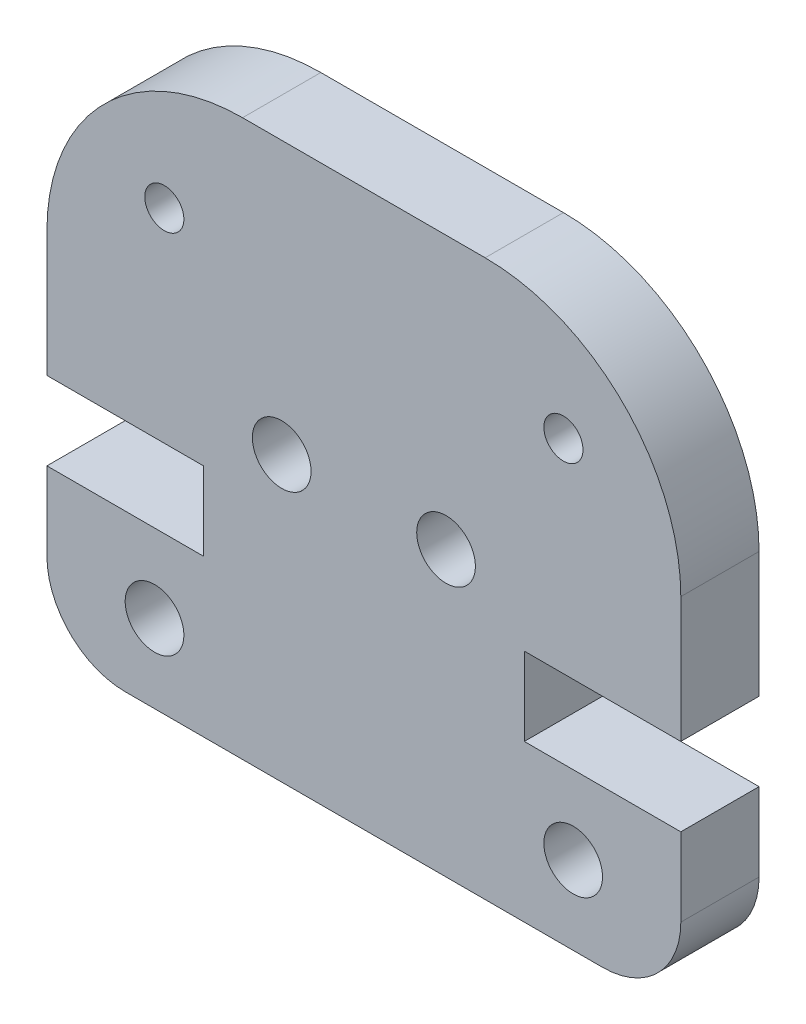
ISO-10303-21;
HEADER;
FILE_DESCRIPTION(('STEP AP214'),'2;1');
FILE_NAME('part.step','',(''),(''),'','','');
FILE_SCHEMA(('AUTOMOTIVE_DESIGN { 1 0 10303 214 1 1 1 1 }'));
ENDSEC;
DATA;
#1=APPLICATION_CONTEXT('core data for automotive mechanical design processes');
#2=APPLICATION_PROTOCOL_DEFINITION('international standard','automotive_design',2000,#1);
#3=PRODUCT_CONTEXT('',#1,'mechanical');
#4=PRODUCT('Part','Part','',(#3));
#5=PRODUCT_RELATED_PRODUCT_CATEGORY('part','',(#4));
#6=PRODUCT_DEFINITION_FORMATION('','',#4);
#7=PRODUCT_DEFINITION_CONTEXT('part definition',#1,'design');
#8=PRODUCT_DEFINITION('design','',#6,#7);
#9=PRODUCT_DEFINITION_SHAPE('','',#8);
#10=(LENGTH_UNIT() NAMED_UNIT(*) SI_UNIT(.MILLI.,.METRE.));
#11=(NAMED_UNIT(*) PLANE_ANGLE_UNIT() SI_UNIT($,.RADIAN.));
#12=(NAMED_UNIT(*) SI_UNIT($,.STERADIAN.) SOLID_ANGLE_UNIT());
#13=UNCERTAINTY_MEASURE_WITH_UNIT(LENGTH_MEASURE(1.E-05),#10,'distance_accuracy_value','');
#14=(GEOMETRIC_REPRESENTATION_CONTEXT(3) GLOBAL_UNCERTAINTY_ASSIGNED_CONTEXT((#13)) GLOBAL_UNIT_ASSIGNED_CONTEXT((#10,
#11,#12)) REPRESENTATION_CONTEXT('',''));
#15=CARTESIAN_POINT('',(0.,0.,0.));
#16=DIRECTION('',(0.,0.,1.));
#17=DIRECTION('',(1.,0.,0.));
#18=AXIS2_PLACEMENT_3D('',#15,#16,#17);
#19=CARTESIAN_POINT('',(14.2,2.00000000000002,2.));
#20=DIRECTION('',(0.,0.,-1.));
#21=DIRECTION('',(-1.,0.,0.));
#22=AXIS2_PLACEMENT_3D('',#19,#20,#21);
#23=PLANE('',#22);
#24=CARTESIAN_POINT('',(3.00000000000434,11.2049999999999,2.));
#25=DIRECTION('',(0.,0.,1.));
#26=DIRECTION('',(1.,0.,0.));
#27=AXIS2_PLACEMENT_3D('',#24,#25,#26);
#28=CIRCLE('',#27,0.499999999999944);
#29=CARTESIAN_POINT('',(3.50000000000429,11.2049999999999,2.));
#30=VERTEX_POINT('',#29);
#31=EDGE_CURVE('E352',#30,#30,#28,.T.);
#32=ORIENTED_EDGE('',*,*,#31,.F.);
#33=EDGE_LOOP('',(#32));
#34=FACE_BOUND('',#33,.T.);
#35=CARTESIAN_POINT('',(10.2000000000053,7.25000000000003,2.));
#36=DIRECTION('',(0.,0.,1.));
#37=DIRECTION('',(-1.,0.,0.));
#38=AXIS2_PLACEMENT_3D('',#35,#36,#37);
#39=CIRCLE('',#38,0.75);
#40=CARTESIAN_POINT('',(9.45000000000532,7.25000000000003,2.));
#41=VERTEX_POINT('',#40);
#42=EDGE_CURVE('E364',#41,#41,#39,.T.);
#43=ORIENTED_EDGE('',*,*,#42,.F.);
#44=EDGE_LOOP('',(#43));
#45=FACE_BOUND('',#44,.T.);
#46=CARTESIAN_POINT('',(13.45,2.00000000000002,2.));
#47=DIRECTION('',(0.,0.,1.));
#48=DIRECTION('',(-1.,0.,0.));
#49=AXIS2_PLACEMENT_3D('',#46,#47,#48);
#50=CIRCLE('',#49,0.750000000000004);
#51=CARTESIAN_POINT('',(12.7,2.00000000000002,2.));
#52=VERTEX_POINT('',#51);
#53=EDGE_CURVE('E182',#52,#52,#50,.T.);
#54=ORIENTED_EDGE('',*,*,#53,.F.);
#55=EDGE_LOOP('',(#54));
#56=FACE_BOUND('',#55,.T.);
#57=CARTESIAN_POINT('',(14.2,2.00000000000002,2.));
#58=DIRECTION('',(0.,0.,1.));
#59=DIRECTION('',(-1.,0.,0.));
#60=AXIS2_PLACEMENT_3D('',#57,#58,#59);
#61=CIRCLE('',#60,2.00000000000001);
#62=CARTESIAN_POINT('',(14.2,0.,2.));
#63=VERTEX_POINT('',#62);
#64=CARTESIAN_POINT('',(16.2,2.00000000000002,2.));
#65=VERTEX_POINT('',#64);
#66=EDGE_CURVE('E209',#63,#65,#61,.T.);
#67=ORIENTED_EDGE('',*,*,#66,.T.);
#68=DIRECTION('',(0.,1.,0.));
#69=VECTOR('',#68,1.);
#70=CARTESIAN_POINT('',(16.2,2.00000000000002,2.));
#71=LINE('',#70,#69);
#72=CARTESIAN_POINT('',(16.2,4.00000000000002,2.));
#73=VERTEX_POINT('',#72);
#74=EDGE_CURVE('E117',#65,#73,#71,.T.);
#75=ORIENTED_EDGE('',*,*,#74,.T.);
#76=DIRECTION('',(-1.,0.,0.));
#77=VECTOR('',#76,1.);
#78=CARTESIAN_POINT('',(12.2,4.00000000000002,2.));
#79=LINE('',#78,#77);
#80=CARTESIAN_POINT('',(12.2,4.00000000000002,2.));
#81=VERTEX_POINT('',#80);
#82=EDGE_CURVE('E248',#73,#81,#79,.T.);
#83=ORIENTED_EDGE('',*,*,#82,.T.);
#84=DIRECTION('',(0.,1.,0.));
#85=VECTOR('',#84,1.);
#86=CARTESIAN_POINT('',(12.2,6.00000000000003,2.));
#87=LINE('',#86,#85);
#88=CARTESIAN_POINT('',(12.2,6.00000000000003,2.));
#89=VERTEX_POINT('',#88);
#90=EDGE_CURVE('E267',#81,#89,#87,.T.);
#91=ORIENTED_EDGE('',*,*,#90,.T.);
#92=DIRECTION('',(1.,0.,0.));
#93=VECTOR('',#92,1.);
#94=CARTESIAN_POINT('',(16.2,6.00000000000003,2.));
#95=LINE('',#94,#93);
#96=CARTESIAN_POINT('',(16.2,6.00000000000003,2.));
#97=VERTEX_POINT('',#96);
#98=EDGE_CURVE('E264',#89,#97,#95,.T.);
#99=ORIENTED_EDGE('',*,*,#98,.T.);
#100=DIRECTION('',(0.,1.,0.));
#101=VECTOR('',#100,1.);
#102=CARTESIAN_POINT('',(16.2,9.205,2.));
#103=LINE('',#102,#101);
#104=CARTESIAN_POINT('',(16.2,9.205,2.));
#105=VERTEX_POINT('',#104);
#106=EDGE_CURVE('E266',#97,#105,#103,.T.);
#107=ORIENTED_EDGE('',*,*,#106,.T.);
#108=CARTESIAN_POINT('',(11.2,9.20499999999999,2.));
#109=DIRECTION('',(0.,0.,1.));
#110=DIRECTION('',(-1.,0.,0.));
#111=AXIS2_PLACEMENT_3D('',#108,#109,#110);
#112=CIRCLE('',#111,5.);
#113=CARTESIAN_POINT('',(11.2,14.205,2.));
#114=VERTEX_POINT('',#113);
#115=EDGE_CURVE('E269',#105,#114,#112,.T.);
#116=ORIENTED_EDGE('',*,*,#115,.T.);
#117=DIRECTION('',(-1.,0.,0.));
#118=VECTOR('',#117,1.);
#119=CARTESIAN_POINT('',(5.,14.205,2.));
#120=LINE('',#119,#118);
#121=CARTESIAN_POINT('',(5.,14.205,2.));
#122=VERTEX_POINT('',#121);
#123=EDGE_CURVE('E275',#114,#122,#120,.T.);
#124=ORIENTED_EDGE('',*,*,#123,.T.);
#125=CARTESIAN_POINT('',(5.,9.20499999999999,2.));
#126=DIRECTION('',(0.,0.,1.));
#127=DIRECTION('',(1.,0.,0.));
#128=AXIS2_PLACEMENT_3D('',#125,#126,#127);
#129=CIRCLE('',#128,5.);
#130=CARTESIAN_POINT('',(0.,9.20499999999999,2.));
#131=VERTEX_POINT('',#130);
#132=EDGE_CURVE('E277',#122,#131,#129,.T.);
#133=ORIENTED_EDGE('',*,*,#132,.T.);
#134=DIRECTION('',(0.,-1.,0.));
#135=VECTOR('',#134,1.);
#136=CARTESIAN_POINT('',(0.,9.20499999999999,2.));
#137=LINE('',#136,#135);
#138=CARTESIAN_POINT('',(0.,6.00000000000003,2.));
#139=VERTEX_POINT('',#138);
#140=EDGE_CURVE('E279',#131,#139,#137,.T.);
#141=ORIENTED_EDGE('',*,*,#140,.T.);
#142=DIRECTION('',(1.,0.,0.));
#143=VECTOR('',#142,1.);
#144=CARTESIAN_POINT('',(0.,6.00000000000003,2.));
#145=LINE('',#144,#143);
#146=CARTESIAN_POINT('',(4.00000000000001,6.00000000000003,2.));
#147=VERTEX_POINT('',#146);
#148=EDGE_CURVE('E281',#139,#147,#145,.T.);
#149=ORIENTED_EDGE('',*,*,#148,.T.);
#150=DIRECTION('',(0.,-1.,0.));
#151=VECTOR('',#150,1.);
#152=CARTESIAN_POINT('',(4.00000000000001,6.00000000000003,2.));
#153=LINE('',#152,#151);
#154=CARTESIAN_POINT('',(4.00000000000001,4.00000000000002,2.));
#155=VERTEX_POINT('',#154);
#156=EDGE_CURVE('E283',#147,#155,#153,.T.);
#157=ORIENTED_EDGE('',*,*,#156,.T.);
#158=DIRECTION('',(-1.,0.,0.));
#159=VECTOR('',#158,1.);
#160=CARTESIAN_POINT('',(4.00000000000001,4.00000000000002,2.));
#161=LINE('',#160,#159);
#162=CARTESIAN_POINT('',(0.,4.00000000000003,2.));
#163=VERTEX_POINT('',#162);
#164=EDGE_CURVE('E160',#155,#163,#161,.T.);
#165=ORIENTED_EDGE('',*,*,#164,.T.);
#166=DIRECTION('',(0.,-1.,0.));
#167=VECTOR('',#166,1.);
#168=CARTESIAN_POINT('',(0.,2.00000000000001,2.));
#169=LINE('',#168,#167);
#170=CARTESIAN_POINT('',(0.,2.00000000000001,2.));
#171=VERTEX_POINT('',#170);
#172=EDGE_CURVE('E154',#163,#171,#169,.T.);
#173=ORIENTED_EDGE('',*,*,#172,.T.);
#174=CARTESIAN_POINT('',(2.,2.00000000000001,2.));
#175=DIRECTION('',(0.,0.,1.));
#176=DIRECTION('',(1.,0.,0.));
#177=AXIS2_PLACEMENT_3D('',#174,#175,#176);
#178=CIRCLE('',#177,2.00000000000001);
#179=CARTESIAN_POINT('',(2.,0.,2.));
#180=VERTEX_POINT('',#179);
#181=EDGE_CURVE('E158',#171,#180,#178,.T.);
#182=ORIENTED_EDGE('',*,*,#181,.T.);
#183=DIRECTION('',(1.,0.,0.));
#184=VECTOR('',#183,1.);
#185=CARTESIAN_POINT('',(2.,0.,2.));
#186=LINE('',#185,#184);
#187=EDGE_CURVE('E50',#180,#63,#186,.T.);
#188=ORIENTED_EDGE('',*,*,#187,.T.);
#189=EDGE_LOOP('',(#67,#75,#83,#91,#99,#107,#116,#124,#133,#141,#149,#157,#165,#173,#182,#188));
#190=FACE_BOUND('',#189,.T.);
#191=CARTESIAN_POINT('',(13.1999999999957,11.2049999999999,2.));
#192=DIRECTION('',(0.,0.,1.));
#193=DIRECTION('',(-1.,0.,0.));
#194=AXIS2_PLACEMENT_3D('',#191,#192,#193);
#195=CIRCLE('',#194,0.499999999999945);
#196=CARTESIAN_POINT('',(12.6999999999957,11.2049999999999,2.));
#197=VERTEX_POINT('',#196);
#198=EDGE_CURVE('E370',#197,#197,#195,.T.);
#199=ORIENTED_EDGE('',*,*,#198,.F.);
#200=EDGE_LOOP('',(#199));
#201=FACE_BOUND('',#200,.T.);
#202=CARTESIAN_POINT('',(5.99999999999468,7.25000000000003,2.));
#203=DIRECTION('',(0.,0.,1.));
#204=DIRECTION('',(1.,0.,0.));
#205=AXIS2_PLACEMENT_3D('',#202,#203,#204);
#206=CIRCLE('',#205,0.75);
#207=CARTESIAN_POINT('',(6.74999999999468,7.25000000000003,2.));
#208=VERTEX_POINT('',#207);
#209=EDGE_CURVE('E358',#208,#208,#206,.T.);
#210=ORIENTED_EDGE('',*,*,#209,.F.);
#211=EDGE_LOOP('',(#210));
#212=FACE_BOUND('',#211,.T.);
#213=CARTESIAN_POINT('',(2.75,2.00000000000018,2.));
#214=DIRECTION('',(0.,0.,1.));
#215=DIRECTION('',(1.,0.,0.));
#216=AXIS2_PLACEMENT_3D('',#213,#214,#215);
#217=CIRCLE('',#216,0.750000000000887);
#218=CARTESIAN_POINT('',(3.50000000000089,2.00000000000018,2.));
#219=VERTEX_POINT('',#218);
#220=EDGE_CURVE('E343',#219,#219,#217,.T.);
#221=ORIENTED_EDGE('',*,*,#220,.F.);
#222=EDGE_LOOP('',(#221));
#223=FACE_BOUND('',#222,.T.);
#224=ADVANCED_FACE('F33',(#34,#45,#56,#190,#201,#212,#223),#23,.F.);
#225=CARTESIAN_POINT('',(14.2,2.00000000000002,0.));
#226=DIRECTION('',(0.,0.,-1.));
#227=DIRECTION('',(-1.,0.,0.));
#228=AXIS2_PLACEMENT_3D('',#225,#226,#227);
#229=PLANE('',#228);
#230=CARTESIAN_POINT('',(3.00000000000434,11.2049999999999,0.));
#231=DIRECTION('',(0.,0.,1.));
#232=DIRECTION('',(1.,0.,0.));
#233=AXIS2_PLACEMENT_3D('',#230,#231,#232);
#234=CIRCLE('',#233,0.499999999999944);
#235=CARTESIAN_POINT('',(3.50000000000429,11.2049999999999,0.));
#236=VERTEX_POINT('',#235);
#237=EDGE_CURVE('E349',#236,#236,#234,.T.);
#238=ORIENTED_EDGE('',*,*,#237,.T.);
#239=EDGE_LOOP('',(#238));
#240=FACE_BOUND('',#239,.T.);
#241=CARTESIAN_POINT('',(10.2000000000053,7.25000000000003,0.));
#242=DIRECTION('',(0.,0.,1.));
#243=DIRECTION('',(-1.,0.,0.));
#244=AXIS2_PLACEMENT_3D('',#241,#242,#243);
#245=CIRCLE('',#244,0.75);
#246=CARTESIAN_POINT('',(9.45000000000532,7.25000000000003,0.));
#247=VERTEX_POINT('',#246);
#248=EDGE_CURVE('E361',#247,#247,#245,.T.);
#249=ORIENTED_EDGE('',*,*,#248,.T.);
#250=EDGE_LOOP('',(#249));
#251=FACE_BOUND('',#250,.T.);
#252=CARTESIAN_POINT('',(13.45,2.00000000000002,0.));
#253=DIRECTION('',(0.,0.,1.));
#254=DIRECTION('',(-1.,0.,0.));
#255=AXIS2_PLACEMENT_3D('',#252,#253,#254);
#256=CIRCLE('',#255,0.750000000000004);
#257=CARTESIAN_POINT('',(12.7,2.00000000000002,0.));
#258=VERTEX_POINT('',#257);
#259=EDGE_CURVE('E373',#258,#258,#256,.T.);
#260=ORIENTED_EDGE('',*,*,#259,.T.);
#261=EDGE_LOOP('',(#260));
#262=FACE_BOUND('',#261,.T.);
#263=CARTESIAN_POINT('',(14.2,2.00000000000002,0.));
#264=DIRECTION('',(0.,0.,1.));
#265=DIRECTION('',(-1.,0.,0.));
#266=AXIS2_PLACEMENT_3D('',#263,#264,#265);
#267=CIRCLE('',#266,2.00000000000001);
#268=CARTESIAN_POINT('',(14.2,0.,0.));
#269=VERTEX_POINT('',#268);
#270=CARTESIAN_POINT('',(16.2,2.00000000000002,0.));
#271=VERTEX_POINT('',#270);
#272=EDGE_CURVE('E178',#269,#271,#267,.T.);
#273=ORIENTED_EDGE('',*,*,#272,.F.);
#274=DIRECTION('',(1.,0.,0.));
#275=VECTOR('',#274,1.);
#276=CARTESIAN_POINT('',(2.,0.,0.));
#277=LINE('',#276,#275);
#278=CARTESIAN_POINT('',(2.,0.,0.));
#279=VERTEX_POINT('',#278);
#280=EDGE_CURVE('E109',#279,#269,#277,.T.);
#281=ORIENTED_EDGE('',*,*,#280,.F.);
#282=CARTESIAN_POINT('',(2.,2.00000000000001,0.));
#283=DIRECTION('',(0.,0.,1.));
#284=DIRECTION('',(1.,0.,0.));
#285=AXIS2_PLACEMENT_3D('',#282,#283,#284);
#286=CIRCLE('',#285,2.00000000000001);
#287=CARTESIAN_POINT('',(0.,2.00000000000001,0.));
#288=VERTEX_POINT('',#287);
#289=EDGE_CURVE('E103',#288,#279,#286,.T.);
#290=ORIENTED_EDGE('',*,*,#289,.F.);
#291=DIRECTION('',(0.,-1.,0.));
#292=VECTOR('',#291,1.);
#293=CARTESIAN_POINT('',(0.,2.00000000000001,0.));
#294=LINE('',#293,#292);
#295=CARTESIAN_POINT('',(0.,4.00000000000003,0.));
#296=VERTEX_POINT('',#295);
#297=EDGE_CURVE('E168',#296,#288,#294,.T.);
#298=ORIENTED_EDGE('',*,*,#297,.F.);
#299=DIRECTION('',(-1.,0.,0.));
#300=VECTOR('',#299,1.);
#301=CARTESIAN_POINT('',(4.00000000000001,4.00000000000002,0.));
#302=LINE('',#301,#300);
#303=CARTESIAN_POINT('',(4.00000000000001,4.00000000000002,0.));
#304=VERTEX_POINT('',#303);
#305=EDGE_CURVE('E204',#304,#296,#302,.T.);
#306=ORIENTED_EDGE('',*,*,#305,.F.);
#307=DIRECTION('',(0.,-1.,0.));
#308=VECTOR('',#307,1.);
#309=CARTESIAN_POINT('',(4.00000000000001,6.00000000000003,0.));
#310=LINE('',#309,#308);
#311=CARTESIAN_POINT('',(4.00000000000001,6.00000000000003,0.));
#312=VERTEX_POINT('',#311);
#313=EDGE_CURVE('E202',#312,#304,#310,.T.);
#314=ORIENTED_EDGE('',*,*,#313,.F.);
#315=DIRECTION('',(1.,0.,0.));
#316=VECTOR('',#315,1.);
#317=CARTESIAN_POINT('',(0.,6.00000000000003,0.));
#318=LINE('',#317,#316);
#319=CARTESIAN_POINT('',(0.,6.00000000000003,0.));
#320=VERTEX_POINT('',#319);
#321=EDGE_CURVE('E200',#320,#312,#318,.T.);
#322=ORIENTED_EDGE('',*,*,#321,.F.);
#323=DIRECTION('',(0.,-1.,0.));
#324=VECTOR('',#323,1.);
#325=CARTESIAN_POINT('',(0.,9.20499999999999,0.));
#326=LINE('',#325,#324);
#327=CARTESIAN_POINT('',(0.,9.20499999999999,0.));
#328=VERTEX_POINT('',#327);
#329=EDGE_CURVE('E198',#328,#320,#326,.T.);
#330=ORIENTED_EDGE('',*,*,#329,.F.);
#331=CARTESIAN_POINT('',(5.,9.20499999999999,0.));
#332=DIRECTION('',(0.,0.,1.));
#333=DIRECTION('',(1.,0.,0.));
#334=AXIS2_PLACEMENT_3D('',#331,#332,#333);
#335=CIRCLE('',#334,5.);
#336=CARTESIAN_POINT('',(5.,14.205,0.));
#337=VERTEX_POINT('',#336);
#338=EDGE_CURVE('E196',#337,#328,#335,.T.);
#339=ORIENTED_EDGE('',*,*,#338,.F.);
#340=DIRECTION('',(-1.,0.,0.));
#341=VECTOR('',#340,1.);
#342=CARTESIAN_POINT('',(5.,14.205,0.));
#343=LINE('',#342,#341);
#344=CARTESIAN_POINT('',(11.2,14.205,0.));
#345=VERTEX_POINT('',#344);
#346=EDGE_CURVE('E194',#345,#337,#343,.T.);
#347=ORIENTED_EDGE('',*,*,#346,.F.);
#348=CARTESIAN_POINT('',(11.2,9.20499999999999,0.));
#349=DIRECTION('',(0.,0.,1.));
#350=DIRECTION('',(-1.,0.,0.));
#351=AXIS2_PLACEMENT_3D('',#348,#349,#350);
#352=CIRCLE('',#351,5.);
#353=CARTESIAN_POINT('',(16.2,9.205,0.));
#354=VERTEX_POINT('',#353);
#355=EDGE_CURVE('E192',#354,#345,#352,.T.);
#356=ORIENTED_EDGE('',*,*,#355,.F.);
#357=DIRECTION('',(0.,1.,0.));
#358=VECTOR('',#357,1.);
#359=CARTESIAN_POINT('',(16.2,9.205,0.));
#360=LINE('',#359,#358);
#361=CARTESIAN_POINT('',(16.2,6.00000000000003,0.));
#362=VERTEX_POINT('',#361);
#363=EDGE_CURVE('E190',#362,#354,#360,.T.);
#364=ORIENTED_EDGE('',*,*,#363,.F.);
#365=DIRECTION('',(1.,0.,0.));
#366=VECTOR('',#365,1.);
#367=CARTESIAN_POINT('',(16.2,6.00000000000003,0.));
#368=LINE('',#367,#366);
#369=CARTESIAN_POINT('',(12.2,6.00000000000003,0.));
#370=VERTEX_POINT('',#369);
#371=EDGE_CURVE('E188',#370,#362,#368,.T.);
#372=ORIENTED_EDGE('',*,*,#371,.F.);
#373=DIRECTION('',(0.,1.,0.));
#374=VECTOR('',#373,1.);
#375=CARTESIAN_POINT('',(12.2,6.00000000000003,0.));
#376=LINE('',#375,#374);
#377=CARTESIAN_POINT('',(12.2,4.00000000000002,0.));
#378=VERTEX_POINT('',#377);
#379=EDGE_CURVE('E186',#378,#370,#376,.T.);
#380=ORIENTED_EDGE('',*,*,#379,.F.);
#381=DIRECTION('',(-1.,0.,0.));
#382=VECTOR('',#381,1.);
#383=CARTESIAN_POINT('',(12.2,4.00000000000002,0.));
#384=LINE('',#383,#382);
#385=CARTESIAN_POINT('',(16.2,4.00000000000002,0.));
#386=VERTEX_POINT('',#385);
#387=EDGE_CURVE('E184',#386,#378,#384,.T.);
#388=ORIENTED_EDGE('',*,*,#387,.F.);
#389=DIRECTION('',(0.,1.,0.));
#390=VECTOR('',#389,1.);
#391=CARTESIAN_POINT('',(16.2,2.00000000000002,0.));
#392=LINE('',#391,#390);
#393=EDGE_CURVE('E181',#271,#386,#392,.T.);
#394=ORIENTED_EDGE('',*,*,#393,.F.);
#395=EDGE_LOOP('',(#273,#281,#290,#298,#306,#314,#322,#330,#339,#347,#356,#364,#372,#380,#388,#394));
#396=FACE_BOUND('',#395,.T.);
#397=CARTESIAN_POINT('',(13.1999999999957,11.2049999999999,0.));
#398=DIRECTION('',(0.,0.,1.));
#399=DIRECTION('',(-1.,0.,0.));
#400=AXIS2_PLACEMENT_3D('',#397,#398,#399);
#401=CIRCLE('',#400,0.499999999999945);
#402=CARTESIAN_POINT('',(12.6999999999957,11.2049999999999,0.));
#403=VERTEX_POINT('',#402);
#404=EDGE_CURVE('E367',#403,#403,#401,.T.);
#405=ORIENTED_EDGE('',*,*,#404,.T.);
#406=EDGE_LOOP('',(#405));
#407=FACE_BOUND('',#406,.T.);
#408=CARTESIAN_POINT('',(5.99999999999468,7.25000000000003,0.));
#409=DIRECTION('',(0.,0.,1.));
#410=DIRECTION('',(1.,0.,0.));
#411=AXIS2_PLACEMENT_3D('',#408,#409,#410);
#412=CIRCLE('',#411,0.75);
#413=CARTESIAN_POINT('',(6.74999999999468,7.25000000000003,0.));
#414=VERTEX_POINT('',#413);
#415=EDGE_CURVE('E355',#414,#414,#412,.T.);
#416=ORIENTED_EDGE('',*,*,#415,.T.);
#417=EDGE_LOOP('',(#416));
#418=FACE_BOUND('',#417,.T.);
#419=CARTESIAN_POINT('',(2.75,2.00000000000018,0.));
#420=DIRECTION('',(0.,0.,1.));
#421=DIRECTION('',(1.,0.,0.));
#422=AXIS2_PLACEMENT_3D('',#419,#420,#421);
#423=CIRCLE('',#422,0.750000000000887);
#424=CARTESIAN_POINT('',(3.50000000000089,2.00000000000018,0.));
#425=VERTEX_POINT('',#424);
#426=EDGE_CURVE('E346',#425,#425,#423,.T.);
#427=ORIENTED_EDGE('',*,*,#426,.T.);
#428=EDGE_LOOP('',(#427));
#429=FACE_BOUND('',#428,.T.);
#430=ADVANCED_FACE('F252',(#240,#251,#262,#396,#407,#418,#429),#229,.T.);
#431=CARTESIAN_POINT('',(14.2,2.00000000000002,2.));
#432=DIRECTION('',(0.,0.,-1.));
#433=DIRECTION('',(-1.,0.,0.));
#434=AXIS2_PLACEMENT_3D('',#431,#432,#433);
#435=CYLINDRICAL_SURFACE('',#434,2.00000000000001);
#436=ORIENTED_EDGE('',*,*,#272,.T.);
#437=DIRECTION('',(0.,0.,-1.));
#438=VECTOR('',#437,1.);
#439=CARTESIAN_POINT('',(16.2,2.00000000000002,2.));
#440=LINE('',#439,#438);
#441=EDGE_CURVE('E11',#65,#271,#440,.T.);
#442=ORIENTED_EDGE('',*,*,#441,.F.);
#443=ORIENTED_EDGE('',*,*,#66,.F.);
#444=DIRECTION('',(0.,0.,-1.));
#445=VECTOR('',#444,1.);
#446=CARTESIAN_POINT('',(14.2,0.,2.));
#447=LINE('',#446,#445);
#448=EDGE_CURVE('E174',#63,#269,#447,.T.);
#449=ORIENTED_EDGE('',*,*,#448,.T.);
#450=EDGE_LOOP('',(#436,#442,#443,#449));
#451=FACE_BOUND('',#450,.T.);
#452=ADVANCED_FACE('F35',(#451),#435,.T.);
#453=CARTESIAN_POINT('',(16.2,2.00000000000002,2.));
#454=DIRECTION('',(-1.,0.,0.));
#455=DIRECTION('',(0.,0.,1.));
#456=AXIS2_PLACEMENT_3D('',#453,#454,#455);
#457=PLANE('',#456);
#458=ORIENTED_EDGE('',*,*,#393,.T.);
#459=DIRECTION('',(0.,0.,-1.));
#460=VECTOR('',#459,1.);
#461=CARTESIAN_POINT('',(16.2,4.00000000000002,2.));
#462=LINE('',#461,#460);
#463=EDGE_CURVE('E42',#73,#386,#462,.T.);
#464=ORIENTED_EDGE('',*,*,#463,.F.);
#465=ORIENTED_EDGE('',*,*,#74,.F.);
#466=ORIENTED_EDGE('',*,*,#441,.T.);
#467=EDGE_LOOP('',(#458,#464,#465,#466));
#468=FACE_BOUND('',#467,.T.);
#469=ADVANCED_FACE('F540',(#468),#457,.F.);
#470=CARTESIAN_POINT('',(12.2,4.00000000000002,2.));
#471=DIRECTION('',(0.,-1.,0.));
#472=DIRECTION('',(1.,0.,0.));
#473=AXIS2_PLACEMENT_3D('',#470,#471,#472);
#474=PLANE('',#473);
#475=ORIENTED_EDGE('',*,*,#387,.T.);
#476=DIRECTION('',(0.,0.,-1.));
#477=VECTOR('',#476,1.);
#478=CARTESIAN_POINT('',(12.2,4.00000000000002,2.));
#479=LINE('',#478,#477);
#480=EDGE_CURVE('E240',#81,#378,#479,.T.);
#481=ORIENTED_EDGE('',*,*,#480,.F.);
#482=ORIENTED_EDGE('',*,*,#82,.F.);
#483=ORIENTED_EDGE('',*,*,#463,.T.);
#484=EDGE_LOOP('',(#475,#481,#482,#483));
#485=FACE_BOUND('',#484,.T.);
#486=ADVANCED_FACE('F246',(#485),#474,.F.);
#487=CARTESIAN_POINT('',(12.2,6.00000000000003,2.));
#488=DIRECTION('',(-1.,0.,0.));
#489=DIRECTION('',(0.,0.,1.));
#490=AXIS2_PLACEMENT_3D('',#487,#488,#489);
#491=PLANE('',#490);
#492=ORIENTED_EDGE('',*,*,#379,.T.);
#493=DIRECTION('',(0.,0.,-1.));
#494=VECTOR('',#493,1.);
#495=CARTESIAN_POINT('',(12.2,6.00000000000003,2.));
#496=LINE('',#495,#494);
#497=EDGE_CURVE('E237',#89,#370,#496,.T.);
#498=ORIENTED_EDGE('',*,*,#497,.F.);
#499=ORIENTED_EDGE('',*,*,#90,.F.);
#500=ORIENTED_EDGE('',*,*,#480,.T.);
#501=EDGE_LOOP('',(#492,#498,#499,#500));
#502=FACE_BOUND('',#501,.T.);
#503=ADVANCED_FACE('F258',(#502),#491,.F.);
#504=CARTESIAN_POINT('',(16.2,6.00000000000003,2.));
#505=DIRECTION('',(0.,1.,0.));
#506=DIRECTION('',(-1.,0.,0.));
#507=AXIS2_PLACEMENT_3D('',#504,#505,#506);
#508=PLANE('',#507);
#509=ORIENTED_EDGE('',*,*,#371,.T.);
#510=DIRECTION('',(0.,0.,-1.));
#511=VECTOR('',#510,1.);
#512=CARTESIAN_POINT('',(16.2,6.00000000000003,2.));
#513=LINE('',#512,#511);
#514=EDGE_CURVE('E234',#97,#362,#513,.T.);
#515=ORIENTED_EDGE('',*,*,#514,.F.);
#516=ORIENTED_EDGE('',*,*,#98,.F.);
#517=ORIENTED_EDGE('',*,*,#497,.T.);
#518=EDGE_LOOP('',(#509,#515,#516,#517));
#519=FACE_BOUND('',#518,.T.);
#520=ADVANCED_FACE('F262',(#519),#508,.F.);
#521=CARTESIAN_POINT('',(16.2,9.205,2.));
#522=DIRECTION('',(-1.,0.,0.));
#523=DIRECTION('',(0.,-1.,0.));
#524=AXIS2_PLACEMENT_3D('',#521,#522,#523);
#525=PLANE('',#524);
#526=ORIENTED_EDGE('',*,*,#363,.T.);
#527=DIRECTION('',(0.,0.,-1.));
#528=VECTOR('',#527,1.);
#529=CARTESIAN_POINT('',(16.2,9.205,2.));
#530=LINE('',#529,#528);
#531=EDGE_CURVE('E231',#105,#354,#530,.T.);
#532=ORIENTED_EDGE('',*,*,#531,.F.);
#533=ORIENTED_EDGE('',*,*,#106,.F.);
#534=ORIENTED_EDGE('',*,*,#514,.T.);
#535=EDGE_LOOP('',(#526,#532,#533,#534));
#536=FACE_BOUND('',#535,.T.);
#537=ADVANCED_FACE('F505',(#536),#525,.F.);
#538=CARTESIAN_POINT('',(11.2,9.20499999999999,2.));
#539=DIRECTION('',(0.,0.,-1.));
#540=DIRECTION('',(-1.,0.,0.));
#541=AXIS2_PLACEMENT_3D('',#538,#539,#540);
#542=CYLINDRICAL_SURFACE('',#541,5.);
#543=ORIENTED_EDGE('',*,*,#355,.T.);
#544=DIRECTION('',(0.,0.,-1.));
#545=VECTOR('',#544,1.);
#546=CARTESIAN_POINT('',(11.2,14.205,2.));
#547=LINE('',#546,#545);
#548=EDGE_CURVE('E228',#114,#345,#547,.T.);
#549=ORIENTED_EDGE('',*,*,#548,.F.);
#550=ORIENTED_EDGE('',*,*,#115,.F.);
#551=ORIENTED_EDGE('',*,*,#531,.T.);
#552=EDGE_LOOP('',(#543,#549,#550,#551));
#553=FACE_BOUND('',#552,.T.);
#554=ADVANCED_FACE('F495',(#553),#542,.T.);
#555=CARTESIAN_POINT('',(5.,14.205,2.));
#556=DIRECTION('',(0.,-1.,0.));
#557=DIRECTION('',(0.,0.,-1.));
#558=AXIS2_PLACEMENT_3D('',#555,#556,#557);
#559=PLANE('',#558);
#560=ORIENTED_EDGE('',*,*,#346,.T.);
#561=DIRECTION('',(0.,0.,-1.));
#562=VECTOR('',#561,1.);
#563=CARTESIAN_POINT('',(5.,14.205,2.));
#564=LINE('',#563,#562);
#565=EDGE_CURVE('E225',#122,#337,#564,.T.);
#566=ORIENTED_EDGE('',*,*,#565,.F.);
#567=ORIENTED_EDGE('',*,*,#123,.F.);
#568=ORIENTED_EDGE('',*,*,#548,.T.);
#569=EDGE_LOOP('',(#560,#566,#567,#568));
#570=FACE_BOUND('',#569,.T.);
#571=ADVANCED_FACE('F485',(#570),#559,.F.);
#572=CARTESIAN_POINT('',(5.,9.20499999999999,2.));
#573=DIRECTION('',(0.,0.,-1.));
#574=DIRECTION('',(-1.,0.,0.));
#575=AXIS2_PLACEMENT_3D('',#572,#573,#574);
#576=CYLINDRICAL_SURFACE('',#575,5.);
#577=ORIENTED_EDGE('',*,*,#338,.T.);
#578=DIRECTION('',(0.,0.,-1.));
#579=VECTOR('',#578,1.);
#580=CARTESIAN_POINT('',(0.,9.20499999999999,2.));
#581=LINE('',#580,#579);
#582=EDGE_CURVE('E222',#131,#328,#581,.T.);
#583=ORIENTED_EDGE('',*,*,#582,.F.);
#584=ORIENTED_EDGE('',*,*,#132,.F.);
#585=ORIENTED_EDGE('',*,*,#565,.T.);
#586=EDGE_LOOP('',(#577,#583,#584,#585));
#587=FACE_BOUND('',#586,.T.);
#588=ADVANCED_FACE('F475',(#587),#576,.T.);
#589=CARTESIAN_POINT('',(0.,9.20499999999999,2.));
#590=DIRECTION('',(1.,0.,0.));
#591=DIRECTION('',(0.,0.,-1.));
#592=AXIS2_PLACEMENT_3D('',#589,#590,#591);
#593=PLANE('',#592);
#594=ORIENTED_EDGE('',*,*,#329,.T.);
#595=DIRECTION('',(0.,0.,-1.));
#596=VECTOR('',#595,1.);
#597=CARTESIAN_POINT('',(0.,6.00000000000003,2.));
#598=LINE('',#597,#596);
#599=EDGE_CURVE('E219',#139,#320,#598,.T.);
#600=ORIENTED_EDGE('',*,*,#599,.F.);
#601=ORIENTED_EDGE('',*,*,#140,.F.);
#602=ORIENTED_EDGE('',*,*,#582,.T.);
#603=EDGE_LOOP('',(#594,#600,#601,#602));
#604=FACE_BOUND('',#603,.T.);
#605=ADVANCED_FACE('F465',(#604),#593,.F.);
#606=CARTESIAN_POINT('',(0.,6.00000000000003,2.));
#607=DIRECTION('',(0.,1.,0.));
#608=DIRECTION('',(-1.,0.,0.));
#609=AXIS2_PLACEMENT_3D('',#606,#607,#608);
#610=PLANE('',#609);
#611=ORIENTED_EDGE('',*,*,#321,.T.);
#612=DIRECTION('',(0.,0.,-1.));
#613=VECTOR('',#612,1.);
#614=CARTESIAN_POINT('',(4.00000000000001,6.00000000000003,2.));
#615=LINE('',#614,#613);
#616=EDGE_CURVE('E216',#147,#312,#615,.T.);
#617=ORIENTED_EDGE('',*,*,#616,.F.);
#618=ORIENTED_EDGE('',*,*,#148,.F.);
#619=ORIENTED_EDGE('',*,*,#599,.T.);
#620=EDGE_LOOP('',(#611,#617,#618,#619));
#621=FACE_BOUND('',#620,.T.);
#622=ADVANCED_FACE('F456',(#621),#610,.F.);
#623=CARTESIAN_POINT('',(4.00000000000001,6.00000000000003,2.));
#624=DIRECTION('',(1.,0.,0.));
#625=DIRECTION('',(0.,0.,-1.));
#626=AXIS2_PLACEMENT_3D('',#623,#624,#625);
#627=PLANE('',#626);
#628=ORIENTED_EDGE('',*,*,#313,.T.);
#629=DIRECTION('',(0.,0.,-1.));
#630=VECTOR('',#629,1.);
#631=CARTESIAN_POINT('',(4.00000000000001,4.00000000000002,2.));
#632=LINE('',#631,#630);
#633=EDGE_CURVE('E213',#155,#304,#632,.T.);
#634=ORIENTED_EDGE('',*,*,#633,.F.);
#635=ORIENTED_EDGE('',*,*,#156,.F.);
#636=ORIENTED_EDGE('',*,*,#616,.T.);
#637=EDGE_LOOP('',(#628,#634,#635,#636));
#638=FACE_BOUND('',#637,.T.);
#639=ADVANCED_FACE('F289',(#638),#627,.F.);
#640=CARTESIAN_POINT('',(4.00000000000001,4.00000000000002,2.));
#641=DIRECTION('',(0.,-1.,0.));
#642=DIRECTION('',(1.,0.,0.));
#643=AXIS2_PLACEMENT_3D('',#640,#641,#642);
#644=PLANE('',#643);
#645=ORIENTED_EDGE('',*,*,#305,.T.);
#646=DIRECTION('',(0.,0.,-1.));
#647=VECTOR('',#646,1.);
#648=CARTESIAN_POINT('',(0.,4.00000000000003,2.));
#649=LINE('',#648,#647);
#650=EDGE_CURVE('E169',#163,#296,#649,.T.);
#651=ORIENTED_EDGE('',*,*,#650,.F.);
#652=ORIENTED_EDGE('',*,*,#164,.F.);
#653=ORIENTED_EDGE('',*,*,#633,.T.);
#654=EDGE_LOOP('',(#645,#651,#652,#653));
#655=FACE_BOUND('',#654,.T.);
#656=ADVANCED_FACE('F293',(#655),#644,.F.);
#657=CARTESIAN_POINT('',(0.,2.00000000000001,2.));
#658=DIRECTION('',(1.,0.,0.));
#659=DIRECTION('',(0.,0.,-1.));
#660=AXIS2_PLACEMENT_3D('',#657,#658,#659);
#661=PLANE('',#660);
#662=ORIENTED_EDGE('',*,*,#297,.T.);
#663=DIRECTION('',(0.,0.,-1.));
#664=VECTOR('',#663,1.);
#665=CARTESIAN_POINT('',(0.,2.00000000000001,2.));
#666=LINE('',#665,#664);
#667=EDGE_CURVE('E165',#171,#288,#666,.T.);
#668=ORIENTED_EDGE('',*,*,#667,.F.);
#669=ORIENTED_EDGE('',*,*,#172,.F.);
#670=ORIENTED_EDGE('',*,*,#650,.T.);
#671=EDGE_LOOP('',(#662,#668,#669,#670));
#672=FACE_BOUND('',#671,.T.);
#673=ADVANCED_FACE('F166',(#672),#661,.F.);
#674=CARTESIAN_POINT('',(2.,2.00000000000001,2.));
#675=DIRECTION('',(0.,0.,-1.));
#676=DIRECTION('',(-1.,0.,0.));
#677=AXIS2_PLACEMENT_3D('',#674,#675,#676);
#678=CYLINDRICAL_SURFACE('',#677,2.00000000000001);
#679=ORIENTED_EDGE('',*,*,#289,.T.);
#680=DIRECTION('',(0.,0.,-1.));
#681=VECTOR('',#680,1.);
#682=CARTESIAN_POINT('',(2.,0.,2.));
#683=LINE('',#682,#681);
#684=EDGE_CURVE('E170',#180,#279,#683,.T.);
#685=ORIENTED_EDGE('',*,*,#684,.F.);
#686=ORIENTED_EDGE('',*,*,#181,.F.);
#687=ORIENTED_EDGE('',*,*,#667,.T.);
#688=EDGE_LOOP('',(#679,#685,#686,#687));
#689=FACE_BOUND('',#688,.T.);
#690=ADVANCED_FACE('F172',(#689),#678,.T.);
#691=CARTESIAN_POINT('',(2.,0.,2.));
#692=DIRECTION('',(0.,1.,0.));
#693=DIRECTION('',(-1.,0.,0.));
#694=AXIS2_PLACEMENT_3D('',#691,#692,#693);
#695=PLANE('',#694);
#696=ORIENTED_EDGE('',*,*,#280,.T.);
#697=ORIENTED_EDGE('',*,*,#448,.F.);
#698=ORIENTED_EDGE('',*,*,#187,.F.);
#699=ORIENTED_EDGE('',*,*,#684,.T.);
#700=EDGE_LOOP('',(#696,#697,#698,#699));
#701=FACE_BOUND('',#700,.T.);
#702=ADVANCED_FACE('F297',(#701),#695,.F.);
#703=CARTESIAN_POINT('',(13.45,2.00000000000002,2.));
#704=DIRECTION('',(0.,0.,-1.));
#705=DIRECTION('',(-1.,0.,0.));
#706=AXIS2_PLACEMENT_3D('',#703,#704,#705);
#707=CYLINDRICAL_SURFACE('',#706,0.750000000000004);
#708=ORIENTED_EDGE('',*,*,#53,.T.);
#709=EDGE_LOOP('',(#708));
#710=FACE_BOUND('',#709,.T.);
#711=ORIENTED_EDGE('',*,*,#259,.F.);
#712=EDGE_LOOP('',(#711));
#713=FACE_BOUND('',#712,.T.);
#714=ADVANCED_FACE('F299',(#710,#713),#707,.F.);
#715=CARTESIAN_POINT('',(13.1999999999957,11.2049999999999,2.));
#716=DIRECTION('',(0.,0.,-1.));
#717=DIRECTION('',(-1.,0.,0.));
#718=AXIS2_PLACEMENT_3D('',#715,#716,#717);
#719=CYLINDRICAL_SURFACE('',#718,0.499999999999945);
#720=ORIENTED_EDGE('',*,*,#198,.T.);
#721=EDGE_LOOP('',(#720));
#722=FACE_BOUND('',#721,.T.);
#723=ORIENTED_EDGE('',*,*,#404,.F.);
#724=EDGE_LOOP('',(#723));
#725=FACE_BOUND('',#724,.T.);
#726=ADVANCED_FACE('F305',(#722,#725),#719,.F.);
#727=CARTESIAN_POINT('',(10.2000000000053,7.25000000000003,2.));
#728=DIRECTION('',(0.,0.,-1.));
#729=DIRECTION('',(-1.,0.,0.));
#730=AXIS2_PLACEMENT_3D('',#727,#728,#729);
#731=CYLINDRICAL_SURFACE('',#730,0.75);
#732=ORIENTED_EDGE('',*,*,#42,.T.);
#733=EDGE_LOOP('',(#732));
#734=FACE_BOUND('',#733,.T.);
#735=ORIENTED_EDGE('',*,*,#248,.F.);
#736=EDGE_LOOP('',(#735));
#737=FACE_BOUND('',#736,.T.);
#738=ADVANCED_FACE('F322',(#734,#737),#731,.F.);
#739=CARTESIAN_POINT('',(5.99999999999468,7.25000000000003,2.));
#740=DIRECTION('',(0.,0.,-1.));
#741=DIRECTION('',(-1.,0.,0.));
#742=AXIS2_PLACEMENT_3D('',#739,#740,#741);
#743=CYLINDRICAL_SURFACE('',#742,0.75);
#744=ORIENTED_EDGE('',*,*,#209,.T.);
#745=EDGE_LOOP('',(#744));
#746=FACE_BOUND('',#745,.T.);
#747=ORIENTED_EDGE('',*,*,#415,.F.);
#748=EDGE_LOOP('',(#747));
#749=FACE_BOUND('',#748,.T.);
#750=ADVANCED_FACE('F326',(#746,#749),#743,.F.);
#751=CARTESIAN_POINT('',(3.00000000000434,11.2049999999999,2.));
#752=DIRECTION('',(0.,0.,-1.));
#753=DIRECTION('',(-1.,0.,0.));
#754=AXIS2_PLACEMENT_3D('',#751,#752,#753);
#755=CYLINDRICAL_SURFACE('',#754,0.499999999999944);
#756=ORIENTED_EDGE('',*,*,#31,.T.);
#757=EDGE_LOOP('',(#756));
#758=FACE_BOUND('',#757,.T.);
#759=ORIENTED_EDGE('',*,*,#237,.F.);
#760=EDGE_LOOP('',(#759));
#761=FACE_BOUND('',#760,.T.);
#762=ADVANCED_FACE('F330',(#758,#761),#755,.F.);
#763=CARTESIAN_POINT('',(2.75,2.00000000000018,2.));
#764=DIRECTION('',(0.,0.,-1.));
#765=DIRECTION('',(-1.,0.,0.));
#766=AXIS2_PLACEMENT_3D('',#763,#764,#765);
#767=CYLINDRICAL_SURFACE('',#766,0.750000000000887);
#768=ORIENTED_EDGE('',*,*,#220,.T.);
#769=EDGE_LOOP('',(#768));
#770=FACE_BOUND('',#769,.T.);
#771=ORIENTED_EDGE('',*,*,#426,.F.);
#772=EDGE_LOOP('',(#771));
#773=FACE_BOUND('',#772,.T.);
#774=ADVANCED_FACE('F334',(#770,#773),#767,.F.);
#775=CLOSED_SHELL('',(#224,#430,#452,#469,#486,#503,#520,#537,#554,#571,#588,#605,#622,#639,
#656,#673,#690,#702,#714,#726,#738,#750,#762,#774));
#776=MANIFOLD_SOLID_BREP('B2',#775);
#777=ADVANCED_BREP_SHAPE_REPRESENTATION('',(#18,#776),#14);
#778=SHAPE_DEFINITION_REPRESENTATION(#9,#777);
ENDSEC;
END-ISO-10303-21;
